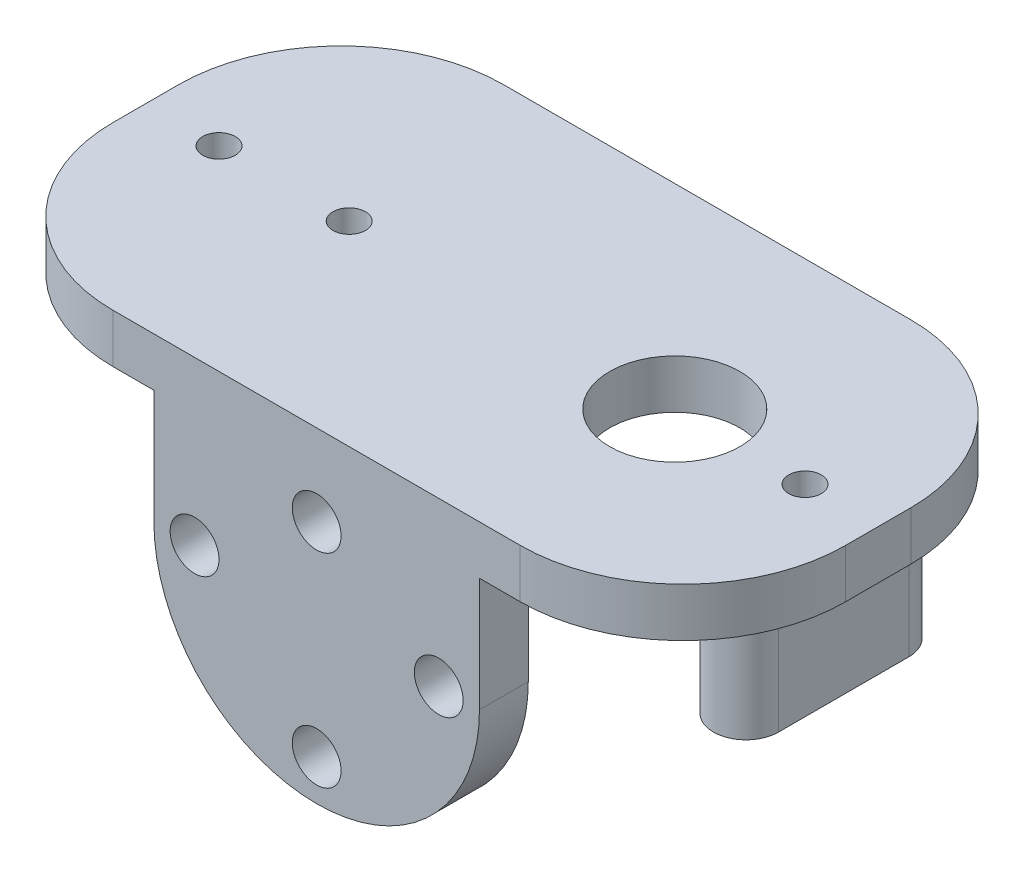
ISO-10303-21;
HEADER;
FILE_DESCRIPTION(('STEP AP214'),'2;1');
FILE_NAME('part.step','',(''),(''),'','','');
FILE_SCHEMA(('AUTOMOTIVE_DESIGN { 1 0 10303 214 1 1 1 1 }'));
ENDSEC;
DATA;
#1=APPLICATION_CONTEXT('core data for automotive mechanical design processes');
#2=APPLICATION_PROTOCOL_DEFINITION('international standard','automotive_design',2000,#1);
#3=PRODUCT_CONTEXT('',#1,'mechanical');
#4=PRODUCT('Part','Part','',(#3));
#5=PRODUCT_RELATED_PRODUCT_CATEGORY('part','',(#4));
#6=PRODUCT_DEFINITION_FORMATION('','',#4);
#7=PRODUCT_DEFINITION_CONTEXT('part definition',#1,'design');
#8=PRODUCT_DEFINITION('design','',#6,#7);
#9=PRODUCT_DEFINITION_SHAPE('','',#8);
#10=(LENGTH_UNIT() NAMED_UNIT(*) SI_UNIT(.MILLI.,.METRE.));
#11=(NAMED_UNIT(*) PLANE_ANGLE_UNIT() SI_UNIT($,.RADIAN.));
#12=(NAMED_UNIT(*) SI_UNIT($,.STERADIAN.) SOLID_ANGLE_UNIT());
#13=UNCERTAINTY_MEASURE_WITH_UNIT(LENGTH_MEASURE(1.E-05),#10,'distance_accuracy_value','');
#14=(GEOMETRIC_REPRESENTATION_CONTEXT(3) GLOBAL_UNCERTAINTY_ASSIGNED_CONTEXT((#13)) GLOBAL_UNIT_ASSIGNED_CONTEXT((#10,
#11,#12)) REPRESENTATION_CONTEXT('',''));
#15=CARTESIAN_POINT('',(0.,0.,0.));
#16=DIRECTION('',(0.,0.,1.));
#17=DIRECTION('',(1.,0.,0.));
#18=AXIS2_PLACEMENT_3D('',#15,#16,#17);
#19=CARTESIAN_POINT('',(18.7492490636064,-2.,0.11463342872871));
#20=DIRECTION('',(0.,-1.,0.));
#21=DIRECTION('',(0.,0.,-1.));
#22=AXIS2_PLACEMENT_3D('',#19,#20,#21);
#23=PLANE('',#22);
#24=CARTESIAN_POINT('',(18.7492490636064,-2.,0.11463342872871));
#25=DIRECTION('',(0.,-1.,0.));
#26=DIRECTION('',(0.,0.,-1.));
#27=AXIS2_PLACEMENT_3D('',#24,#25,#26);
#28=CIRCLE('',#27,1.);
#29=CARTESIAN_POINT('',(18.7492490636064,-2.,-0.885366571271291));
#30=VERTEX_POINT('',#29);
#31=EDGE_CURVE('E20',#30,#30,#28,.T.);
#32=ORIENTED_EDGE('',*,*,#31,.T.);
#33=EDGE_LOOP('',(#32));
#34=FACE_BOUND('',#33,.T.);
#35=ADVANCED_FACE('F17',(#34),#23,.T.);
#36=CARTESIAN_POINT('',(-9.24834793993413,-2.,-0.252193543203161));
#37=DIRECTION('',(0.,-1.,0.));
#38=DIRECTION('',(0.,0.,-1.));
#39=AXIS2_PLACEMENT_3D('',#36,#37,#38);
#40=PLANE('',#39);
#41=CARTESIAN_POINT('',(-9.24834793993413,-2.,-0.252193543203161));
#42=DIRECTION('',(0.,-1.,0.));
#43=DIRECTION('',(0.,0.,-1.));
#44=AXIS2_PLACEMENT_3D('',#41,#42,#43);
#45=CIRCLE('',#44,1.);
#46=CARTESIAN_POINT('',(-9.24834793993413,-2.,-1.25219354320316));
#47=VERTEX_POINT('',#46);
#48=EDGE_CURVE('E300',#47,#47,#45,.T.);
#49=ORIENTED_EDGE('',*,*,#48,.T.);
#50=EDGE_LOOP('',(#49));
#51=FACE_BOUND('',#50,.T.);
#52=ADVANCED_FACE('F311',(#51),#40,.T.);
#53=CARTESIAN_POINT('',(18.7492490636064,-2.,0.11463342872871));
#54=DIRECTION('',(0.,-1.,0.));
#55=DIRECTION('',(0.,0.,-1.));
#56=AXIS2_PLACEMENT_3D('',#53,#54,#55);
#57=CYLINDRICAL_SURFACE('',#56,1.);
#58=CARTESIAN_POINT('',(18.7492490636064,-7.,0.11463342872871));
#59=DIRECTION('',(0.,-1.,0.));
#60=DIRECTION('',(0.,0.,-1.));
#61=AXIS2_PLACEMENT_3D('',#58,#59,#60);
#62=CIRCLE('',#61,1.);
#63=CARTESIAN_POINT('',(18.7492490636064,-7.,-0.885366571271291));
#64=VERTEX_POINT('',#63);
#65=EDGE_CURVE('E298',#64,#64,#62,.F.);
#66=ORIENTED_EDGE('',*,*,#65,.F.);
#67=EDGE_LOOP('',(#66));
#68=FACE_BOUND('',#67,.T.);
#69=ORIENTED_EDGE('',*,*,#31,.F.);
#70=EDGE_LOOP('',(#69));
#71=FACE_BOUND('',#70,.T.);
#72=ADVANCED_FACE('F308',(#68,#71),#57,.F.);
#73=CARTESIAN_POINT('',(-9.24834793993413,-2.,-0.252193543203161));
#74=DIRECTION('',(0.,-1.,0.));
#75=DIRECTION('',(0.,0.,-1.));
#76=AXIS2_PLACEMENT_3D('',#73,#74,#75);
#77=CYLINDRICAL_SURFACE('',#76,1.);
#78=CARTESIAN_POINT('',(-9.24834793993413,-7.,-0.252193543203161));
#79=DIRECTION('',(0.,-1.,0.));
#80=DIRECTION('',(0.,0.,-1.));
#81=AXIS2_PLACEMENT_3D('',#78,#79,#80);
#82=CIRCLE('',#81,1.);
#83=CARTESIAN_POINT('',(-9.24834793993413,-7.,-1.25219354320316));
#84=VERTEX_POINT('',#83);
#85=EDGE_CURVE('E164',#84,#84,#82,.F.);
#86=ORIENTED_EDGE('',*,*,#85,.F.);
#87=EDGE_LOOP('',(#86));
#88=FACE_BOUND('',#87,.T.);
#89=ORIENTED_EDGE('',*,*,#48,.F.);
#90=EDGE_LOOP('',(#89));
#91=FACE_BOUND('',#90,.T.);
#92=ADVANCED_FACE('F310',(#88,#91),#77,.F.);
#93=CARTESIAN_POINT('',(0.,-7.,0.));
#94=DIRECTION('',(0.,-1.,0.));
#95=DIRECTION('',(0.,0.,-1.));
#96=AXIS2_PLACEMENT_3D('',#93,#94,#95);
#97=PLANE('',#96);
#98=DIRECTION('',(0.,0.,1.));
#99=VECTOR('',#98,1.);
#100=CARTESIAN_POINT('',(20.3736323404437,-7.,6.));
#101=LINE('',#100,#99);
#102=CARTESIAN_POINT('',(20.3736323404437,-7.,-4.));
#103=VERTEX_POINT('',#102);
#104=CARTESIAN_POINT('',(20.3736323404437,-7.,4.));
#105=VERTEX_POINT('',#104);
#106=EDGE_CURVE('E184',#103,#105,#101,.T.);
#107=ORIENTED_EDGE('',*,*,#106,.T.);
#108=CARTESIAN_POINT('',(18.3736323404437,-7.,4.));
#109=DIRECTION('',(0.,1.,0.));
#110=DIRECTION('',(0.,0.,1.));
#111=AXIS2_PLACEMENT_3D('',#108,#109,#110);
#112=CIRCLE('',#111,2.);
#113=CARTESIAN_POINT('',(16.3736323404437,-7.,4.));
#114=VERTEX_POINT('',#113);
#115=EDGE_CURVE('E161',#114,#105,#112,.T.);
#116=ORIENTED_EDGE('',*,*,#115,.F.);
#117=DIRECTION('',(0.,0.,-1.));
#118=VECTOR('',#117,1.);
#119=CARTESIAN_POINT('',(16.3736323404437,-7.,6.));
#120=LINE('',#119,#118);
#121=CARTESIAN_POINT('',(16.3736323404437,-7.,-4.));
#122=VERTEX_POINT('',#121);
#123=EDGE_CURVE('E158',#114,#122,#120,.T.);
#124=ORIENTED_EDGE('',*,*,#123,.T.);
#125=CARTESIAN_POINT('',(18.3736323404437,-7.,-4.));
#126=DIRECTION('',(0.,1.,0.));
#127=DIRECTION('',(0.,0.,1.));
#128=AXIS2_PLACEMENT_3D('',#125,#126,#127);
#129=CIRCLE('',#128,2.);
#130=EDGE_CURVE('E146',#103,#122,#129,.T.);
#131=ORIENTED_EDGE('',*,*,#130,.F.);
#132=EDGE_LOOP('',(#107,#116,#124,#131));
#133=FACE_BOUND('',#132,.T.);
#134=ORIENTED_EDGE('',*,*,#65,.T.);
#135=EDGE_LOOP('',(#134));
#136=FACE_BOUND('',#135,.T.);
#137=ADVANCED_FACE('F159',(#133,#136),#97,.T.);
#138=CARTESIAN_POINT('',(0.,-7.,0.));
#139=DIRECTION('',(0.,-1.,0.));
#140=DIRECTION('',(0.,0.,-1.));
#141=AXIS2_PLACEMENT_3D('',#138,#139,#140);
#142=PLANE('',#141);
#143=DIRECTION('',(0.,0.,1.));
#144=VECTOR('',#143,1.);
#145=CARTESIAN_POINT('',(-7.12636765955629,-7.,6.));
#146=LINE('',#145,#144);
#147=CARTESIAN_POINT('',(-7.12636765955629,-7.,-4.));
#148=VERTEX_POINT('',#147);
#149=CARTESIAN_POINT('',(-7.12636765955629,-7.,4.));
#150=VERTEX_POINT('',#149);
#151=EDGE_CURVE('E179',#148,#150,#146,.T.);
#152=ORIENTED_EDGE('',*,*,#151,.T.);
#153=CARTESIAN_POINT('',(-9.12636765955629,-7.,4.));
#154=DIRECTION('',(0.,1.,0.));
#155=DIRECTION('',(0.,0.,1.));
#156=AXIS2_PLACEMENT_3D('',#153,#154,#155);
#157=CIRCLE('',#156,2.);
#158=CARTESIAN_POINT('',(-11.1263676595563,-7.,4.));
#159=VERTEX_POINT('',#158);
#160=EDGE_CURVE('E291',#159,#150,#157,.T.);
#161=ORIENTED_EDGE('',*,*,#160,.F.);
#162=DIRECTION('',(0.,0.,-1.));
#163=VECTOR('',#162,1.);
#164=CARTESIAN_POINT('',(-11.1263676595563,-7.,6.));
#165=LINE('',#164,#163);
#166=CARTESIAN_POINT('',(-11.1263676595563,-7.,-4.));
#167=VERTEX_POINT('',#166);
#168=EDGE_CURVE('E174',#159,#167,#165,.T.);
#169=ORIENTED_EDGE('',*,*,#168,.T.);
#170=CARTESIAN_POINT('',(-9.12636765955629,-7.,-4.));
#171=DIRECTION('',(0.,1.,0.));
#172=DIRECTION('',(0.,0.,1.));
#173=AXIS2_PLACEMENT_3D('',#170,#171,#172);
#174=CIRCLE('',#173,2.);
#175=EDGE_CURVE('E293',#148,#167,#174,.T.);
#176=ORIENTED_EDGE('',*,*,#175,.F.);
#177=EDGE_LOOP('',(#152,#161,#169,#176));
#178=FACE_BOUND('',#177,.T.);
#179=ORIENTED_EDGE('',*,*,#85,.T.);
#180=EDGE_LOOP('',(#179));
#181=FACE_BOUND('',#180,.T.);
#182=ADVANCED_FACE('F450',(#178,#181),#142,.T.);
#183=CARTESIAN_POINT('',(16.3736323404437,-7.,6.));
#184=DIRECTION('',(1.,0.,0.));
#185=DIRECTION('',(0.,0.,-1.));
#186=AXIS2_PLACEMENT_3D('',#183,#184,#185);
#187=PLANE('',#186);
#188=DIRECTION('',(0.,1.,0.));
#189=VECTOR('',#188,1.);
#190=CARTESIAN_POINT('',(16.3736323404437,-7.,-4.));
#191=LINE('',#190,#189);
#192=CARTESIAN_POINT('',(16.3736323404437,0.,-4.));
#193=VERTEX_POINT('',#192);
#194=EDGE_CURVE('E152',#122,#193,#191,.T.);
#195=ORIENTED_EDGE('',*,*,#194,.F.);
#196=ORIENTED_EDGE('',*,*,#123,.F.);
#197=DIRECTION('',(0.,1.,0.));
#198=VECTOR('',#197,1.);
#199=CARTESIAN_POINT('',(16.3736323404437,-7.,4.));
#200=LINE('',#199,#198);
#201=CARTESIAN_POINT('',(16.3736323404437,0.,4.));
#202=VERTEX_POINT('',#201);
#203=EDGE_CURVE('E178',#202,#114,#200,.F.);
#204=ORIENTED_EDGE('',*,*,#203,.F.);
#205=DIRECTION('',(0.,0.,1.));
#206=VECTOR('',#205,1.);
#207=CARTESIAN_POINT('',(16.3736323404437,0.,0.));
#208=LINE('',#207,#206);
#209=EDGE_CURVE('E169',#202,#193,#208,.F.);
#210=ORIENTED_EDGE('',*,*,#209,.T.);
#211=EDGE_LOOP('',(#195,#196,#204,#210));
#212=FACE_BOUND('',#211,.T.);
#213=ADVANCED_FACE('F167',(#212),#187,.F.);
#214=CARTESIAN_POINT('',(18.3736323404437,-7.,-4.));
#215=DIRECTION('',(0.,1.,0.));
#216=DIRECTION('',(0.,0.,1.));
#217=AXIS2_PLACEMENT_3D('',#214,#215,#216);
#218=CYLINDRICAL_SURFACE('',#217,2.);
#219=ORIENTED_EDGE('',*,*,#130,.T.);
#220=ORIENTED_EDGE('',*,*,#194,.T.);
#221=CARTESIAN_POINT('',(18.3736323404437,0.,-4.));
#222=DIRECTION('',(0.,1.,0.));
#223=DIRECTION('',(0.,0.,1.));
#224=AXIS2_PLACEMENT_3D('',#221,#222,#223);
#225=CIRCLE('',#224,2.);
#226=CARTESIAN_POINT('',(20.3736323404437,0.,-4.));
#227=VERTEX_POINT('',#226);
#228=EDGE_CURVE('E271',#193,#227,#225,.F.);
#229=ORIENTED_EDGE('',*,*,#228,.T.);
#230=DIRECTION('',(0.,1.,0.));
#231=VECTOR('',#230,1.);
#232=CARTESIAN_POINT('',(20.3736323404437,-7.,-4.));
#233=LINE('',#232,#231);
#234=EDGE_CURVE('E154',#227,#103,#233,.F.);
#235=ORIENTED_EDGE('',*,*,#234,.T.);
#236=EDGE_LOOP('',(#219,#220,#229,#235));
#237=FACE_BOUND('',#236,.T.);
#238=ADVANCED_FACE('F150',(#237),#218,.T.);
#239=CARTESIAN_POINT('',(20.3736323404437,-7.,6.));
#240=DIRECTION('',(-1.,0.,0.));
#241=DIRECTION('',(0.,0.,1.));
#242=AXIS2_PLACEMENT_3D('',#239,#240,#241);
#243=PLANE('',#242);
#244=ORIENTED_EDGE('',*,*,#234,.F.);
#245=DIRECTION('',(0.,0.,1.));
#246=VECTOR('',#245,1.);
#247=CARTESIAN_POINT('',(20.3736323404437,0.,0.));
#248=LINE('',#247,#246);
#249=CARTESIAN_POINT('',(20.3736323404437,0.,4.));
#250=VERTEX_POINT('',#249);
#251=EDGE_CURVE('E270',#227,#250,#248,.T.);
#252=ORIENTED_EDGE('',*,*,#251,.T.);
#253=DIRECTION('',(0.,1.,0.));
#254=VECTOR('',#253,1.);
#255=CARTESIAN_POINT('',(20.3736323404437,-7.,4.));
#256=LINE('',#255,#254);
#257=EDGE_CURVE('E185',#105,#250,#256,.T.);
#258=ORIENTED_EDGE('',*,*,#257,.F.);
#259=ORIENTED_EDGE('',*,*,#106,.F.);
#260=EDGE_LOOP('',(#244,#252,#258,#259));
#261=FACE_BOUND('',#260,.T.);
#262=ADVANCED_FACE('F441',(#261),#243,.F.);
#263=CARTESIAN_POINT('',(18.3736323404437,-7.,4.));
#264=DIRECTION('',(0.,1.,0.));
#265=DIRECTION('',(0.,0.,1.));
#266=AXIS2_PLACEMENT_3D('',#263,#264,#265);
#267=CYLINDRICAL_SURFACE('',#266,2.);
#268=CARTESIAN_POINT('',(18.3736323404437,0.,4.));
#269=DIRECTION('',(0.,1.,0.));
#270=DIRECTION('',(0.,0.,1.));
#271=AXIS2_PLACEMENT_3D('',#268,#269,#270);
#272=CIRCLE('',#271,2.);
#273=EDGE_CURVE('E267',#250,#202,#272,.F.);
#274=ORIENTED_EDGE('',*,*,#273,.T.);
#275=ORIENTED_EDGE('',*,*,#203,.T.);
#276=ORIENTED_EDGE('',*,*,#115,.T.);
#277=ORIENTED_EDGE('',*,*,#257,.T.);
#278=EDGE_LOOP('',(#274,#275,#276,#277));
#279=FACE_BOUND('',#278,.T.);
#280=ADVANCED_FACE('F437',(#279),#267,.T.);
#281=CARTESIAN_POINT('',(-11.1263676595563,-7.,6.));
#282=DIRECTION('',(1.,0.,0.));
#283=DIRECTION('',(0.,0.,-1.));
#284=AXIS2_PLACEMENT_3D('',#281,#282,#283);
#285=PLANE('',#284);
#286=DIRECTION('',(0.,1.,0.));
#287=VECTOR('',#286,1.);
#288=CARTESIAN_POINT('',(-11.1263676595563,-7.,-4.));
#289=LINE('',#288,#287);
#290=CARTESIAN_POINT('',(-11.1263676595563,0.,-4.));
#291=VERTEX_POINT('',#290);
#292=EDGE_CURVE('E177',#167,#291,#289,.T.);
#293=ORIENTED_EDGE('',*,*,#292,.F.);
#294=ORIENTED_EDGE('',*,*,#168,.F.);
#295=DIRECTION('',(0.,1.,0.));
#296=VECTOR('',#295,1.);
#297=CARTESIAN_POINT('',(-11.1263676595563,-7.,4.));
#298=LINE('',#297,#296);
#299=CARTESIAN_POINT('',(-11.1263676595563,0.,4.));
#300=VERTEX_POINT('',#299);
#301=EDGE_CURVE('E290',#300,#159,#298,.F.);
#302=ORIENTED_EDGE('',*,*,#301,.F.);
#303=DIRECTION('',(0.,0.,1.));
#304=VECTOR('',#303,1.);
#305=CARTESIAN_POINT('',(-11.1263676595563,0.,0.));
#306=LINE('',#305,#304);
#307=EDGE_CURVE('E266',#300,#291,#306,.F.);
#308=ORIENTED_EDGE('',*,*,#307,.T.);
#309=EDGE_LOOP('',(#293,#294,#302,#308));
#310=FACE_BOUND('',#309,.T.);
#311=ADVANCED_FACE('F433',(#310),#285,.F.);
#312=CARTESIAN_POINT('',(-9.12636765955629,-7.,-4.));
#313=DIRECTION('',(0.,1.,0.));
#314=DIRECTION('',(0.,0.,1.));
#315=AXIS2_PLACEMENT_3D('',#312,#313,#314);
#316=CYLINDRICAL_SURFACE('',#315,2.);
#317=ORIENTED_EDGE('',*,*,#175,.T.);
#318=ORIENTED_EDGE('',*,*,#292,.T.);
#319=CARTESIAN_POINT('',(-9.12636765955629,0.,-4.));
#320=DIRECTION('',(0.,1.,0.));
#321=DIRECTION('',(0.,0.,1.));
#322=AXIS2_PLACEMENT_3D('',#319,#320,#321);
#323=CIRCLE('',#322,2.);
#324=CARTESIAN_POINT('',(-7.12636765955629,0.,-4.));
#325=VERTEX_POINT('',#324);
#326=EDGE_CURVE('E264',#291,#325,#323,.F.);
#327=ORIENTED_EDGE('',*,*,#326,.T.);
#328=DIRECTION('',(0.,1.,0.));
#329=VECTOR('',#328,1.);
#330=CARTESIAN_POINT('',(-7.12636765955629,-7.,-4.));
#331=LINE('',#330,#329);
#332=EDGE_CURVE('E182',#325,#148,#331,.F.);
#333=ORIENTED_EDGE('',*,*,#332,.T.);
#334=EDGE_LOOP('',(#317,#318,#327,#333));
#335=FACE_BOUND('',#334,.T.);
#336=ADVANCED_FACE('F429',(#335),#316,.T.);
#337=CARTESIAN_POINT('',(-7.12636765955629,-7.,6.));
#338=DIRECTION('',(-1.,0.,0.));
#339=DIRECTION('',(0.,0.,1.));
#340=AXIS2_PLACEMENT_3D('',#337,#338,#339);
#341=PLANE('',#340);
#342=ORIENTED_EDGE('',*,*,#332,.F.);
#343=DIRECTION('',(0.,0.,1.));
#344=VECTOR('',#343,1.);
#345=CARTESIAN_POINT('',(-7.12636765955629,0.,0.));
#346=LINE('',#345,#344);
#347=CARTESIAN_POINT('',(-7.12636765955629,0.,4.));
#348=VERTEX_POINT('',#347);
#349=EDGE_CURVE('E263',#325,#348,#346,.T.);
#350=ORIENTED_EDGE('',*,*,#349,.T.);
#351=DIRECTION('',(0.,1.,0.));
#352=VECTOR('',#351,1.);
#353=CARTESIAN_POINT('',(-7.12636765955629,-7.,4.));
#354=LINE('',#353,#352);
#355=EDGE_CURVE('E181',#150,#348,#354,.T.);
#356=ORIENTED_EDGE('',*,*,#355,.F.);
#357=ORIENTED_EDGE('',*,*,#151,.F.);
#358=EDGE_LOOP('',(#342,#350,#356,#357));
#359=FACE_BOUND('',#358,.T.);
#360=ADVANCED_FACE('F425',(#359),#341,.F.);
#361=CARTESIAN_POINT('',(-9.12636765955629,-7.,4.));
#362=DIRECTION('',(0.,1.,0.));
#363=DIRECTION('',(0.,0.,1.));
#364=AXIS2_PLACEMENT_3D('',#361,#362,#363);
#365=CYLINDRICAL_SURFACE('',#364,2.);
#366=CARTESIAN_POINT('',(-9.12636765955629,0.,4.));
#367=DIRECTION('',(0.,1.,0.));
#368=DIRECTION('',(0.,0.,1.));
#369=AXIS2_PLACEMENT_3D('',#366,#367,#368);
#370=CIRCLE('',#369,2.);
#371=EDGE_CURVE('E259',#348,#300,#370,.F.);
#372=ORIENTED_EDGE('',*,*,#371,.T.);
#373=ORIENTED_EDGE('',*,*,#301,.T.);
#374=ORIENTED_EDGE('',*,*,#160,.T.);
#375=ORIENTED_EDGE('',*,*,#355,.T.);
#376=EDGE_LOOP('',(#372,#373,#374,#375));
#377=FACE_BOUND('',#376,.T.);
#378=ADVANCED_FACE('F421',(#377),#365,.T.);
#379=CARTESIAN_POINT('',(-10.,-17.,9.00000000000001));
#380=DIRECTION('',(0.,0.,1.));
#381=DIRECTION('',(1.,0.,0.));
#382=AXIS2_PLACEMENT_3D('',#379,#380,#381);
#383=PLANE('',#382);
#384=CARTESIAN_POINT('',(0.,-7.,9.00000000000001));
#385=DIRECTION('',(0.,0.,1.));
#386=DIRECTION('',(1.,0.,0.));
#387=AXIS2_PLACEMENT_3D('',#384,#385,#386);
#388=CIRCLE('',#387,10.);
#389=CARTESIAN_POINT('',(-10.,-7.,9.00000000000001));
#390=VERTEX_POINT('',#389);
#391=CARTESIAN_POINT('',(10.,-7.,9.00000000000001));
#392=VERTEX_POINT('',#391);
#393=EDGE_CURVE('E273',#390,#392,#388,.T.);
#394=ORIENTED_EDGE('',*,*,#393,.F.);
#395=DIRECTION('',(0.,1.,0.));
#396=VECTOR('',#395,1.);
#397=CARTESIAN_POINT('',(-10.,-17.,9.00000000000001));
#398=LINE('',#397,#396);
#399=CARTESIAN_POINT('',(-10.,0.,9.00000000000001));
#400=VERTEX_POINT('',#399);
#401=EDGE_CURVE('E715',#390,#400,#398,.T.);
#402=ORIENTED_EDGE('',*,*,#401,.T.);
#403=DIRECTION('',(1.,0.,0.));
#404=VECTOR('',#403,1.);
#405=CARTESIAN_POINT('',(0.,0.,9.00000000000001));
#406=LINE('',#405,#404);
#407=CARTESIAN_POINT('',(10.,0.,9.00000000000001));
#408=VERTEX_POINT('',#407);
#409=EDGE_CURVE('E262',#400,#408,#406,.T.);
#410=ORIENTED_EDGE('',*,*,#409,.T.);
#411=DIRECTION('',(0.,1.,0.));
#412=VECTOR('',#411,1.);
#413=CARTESIAN_POINT('',(10.,-17.,9.00000000000001));
#414=LINE('',#413,#412);
#415=EDGE_CURVE('E280',#408,#392,#414,.F.);
#416=ORIENTED_EDGE('',*,*,#415,.T.);
#417=EDGE_LOOP('',(#394,#402,#410,#416));
#418=FACE_BOUND('',#417,.T.);
#419=CARTESIAN_POINT('',(0.,-14.5,9.));
#420=DIRECTION('',(0.,0.,1.));
#421=DIRECTION('',(1.,0.,0.));
#422=AXIS2_PLACEMENT_3D('',#419,#420,#421);
#423=CIRCLE('',#422,1.5);
#424=CARTESIAN_POINT('',(1.5,-14.5,9.));
#425=VERTEX_POINT('',#424);
#426=EDGE_CURVE('E277',#425,#425,#423,.T.);
#427=ORIENTED_EDGE('',*,*,#426,.T.);
#428=EDGE_LOOP('',(#427));
#429=FACE_BOUND('',#428,.T.);
#430=CARTESIAN_POINT('',(-7.5,-7.00000000000007,9.));
#431=DIRECTION('',(0.,0.,1.));
#432=DIRECTION('',(1.,0.,0.));
#433=AXIS2_PLACEMENT_3D('',#430,#431,#432);
#434=CIRCLE('',#433,1.5);
#435=CARTESIAN_POINT('',(-6.,-7.00000000000007,9.));
#436=VERTEX_POINT('',#435);
#437=EDGE_CURVE('E281',#436,#436,#434,.T.);
#438=ORIENTED_EDGE('',*,*,#437,.T.);
#439=EDGE_LOOP('',(#438));
#440=FACE_BOUND('',#439,.T.);
#441=CARTESIAN_POINT('',(7.5,-7.,9.));
#442=DIRECTION('',(0.,0.,1.));
#443=DIRECTION('',(1.,0.,0.));
#444=AXIS2_PLACEMENT_3D('',#441,#442,#443);
#445=CIRCLE('',#444,1.5);
#446=CARTESIAN_POINT('',(9.00000000000001,-7.,9.));
#447=VERTEX_POINT('',#446);
#448=EDGE_CURVE('E284',#447,#447,#445,.T.);
#449=ORIENTED_EDGE('',*,*,#448,.T.);
#450=EDGE_LOOP('',(#449));
#451=FACE_BOUND('',#450,.T.);
#452=CARTESIAN_POINT('',(0.,-2.,9.));
#453=DIRECTION('',(0.,0.,1.));
#454=DIRECTION('',(1.,0.,0.));
#455=AXIS2_PLACEMENT_3D('',#452,#453,#454);
#456=CIRCLE('',#455,1.5);
#457=CARTESIAN_POINT('',(1.5,-2.,9.));
#458=VERTEX_POINT('',#457);
#459=EDGE_CURVE('E287',#458,#458,#456,.T.);
#460=ORIENTED_EDGE('',*,*,#459,.T.);
#461=EDGE_LOOP('',(#460));
#462=FACE_BOUND('',#461,.T.);
#463=ADVANCED_FACE('F417',(#418,#429,#440,#451,#462),#383,.F.);
#464=CARTESIAN_POINT('',(0.,0.,0.));
#465=DIRECTION('',(0.,-1.,0.));
#466=DIRECTION('',(0.,0.,-1.));
#467=AXIS2_PLACEMENT_3D('',#464,#465,#466);
#468=PLANE('',#467);
#469=CARTESIAN_POINT('',(18.,0.,0.));
#470=DIRECTION('',(0.,1.,0.));
#471=DIRECTION('',(0.,0.,1.));
#472=AXIS2_PLACEMENT_3D('',#469,#470,#471);
#473=CIRCLE('',#472,1.);
#474=CARTESIAN_POINT('',(18.,0.,1.));
#475=VERTEX_POINT('',#474);
#476=EDGE_CURVE('E255',#475,#475,#473,.T.);
#477=ORIENTED_EDGE('',*,*,#476,.T.);
#478=EDGE_LOOP('',(#477));
#479=FACE_BOUND('',#478,.T.);
#480=ADVANCED_FACE('F413',(#479),#468,.F.);
#481=CARTESIAN_POINT('',(0.,0.,0.));
#482=DIRECTION('',(0.,-1.,0.));
#483=DIRECTION('',(0.,0.,-1.));
#484=AXIS2_PLACEMENT_3D('',#481,#482,#483);
#485=PLANE('',#484);
#486=CARTESIAN_POINT('',(-10.,0.,0.));
#487=DIRECTION('',(0.,1.,0.));
#488=DIRECTION('',(0.,0.,1.));
#489=AXIS2_PLACEMENT_3D('',#486,#487,#488);
#490=CIRCLE('',#489,1.);
#491=CARTESIAN_POINT('',(-10.,0.,1.));
#492=VERTEX_POINT('',#491);
#493=EDGE_CURVE('E252',#492,#492,#490,.T.);
#494=ORIENTED_EDGE('',*,*,#493,.T.);
#495=EDGE_LOOP('',(#494));
#496=FACE_BOUND('',#495,.T.);
#497=ADVANCED_FACE('F409',(#496),#485,.F.);
#498=CARTESIAN_POINT('',(0.,-2.,9.));
#499=DIRECTION('',(0.,0.,1.));
#500=DIRECTION('',(1.,0.,0.));
#501=AXIS2_PLACEMENT_3D('',#498,#499,#500);
#502=CYLINDRICAL_SURFACE('',#501,1.5);
#503=ORIENTED_EDGE('',*,*,#459,.F.);
#504=EDGE_LOOP('',(#503));
#505=FACE_BOUND('',#504,.T.);
#506=CARTESIAN_POINT('',(0.,-2.,12.));
#507=DIRECTION('',(0.,0.,1.));
#508=DIRECTION('',(1.,0.,0.));
#509=AXIS2_PLACEMENT_3D('',#506,#507,#508);
#510=CIRCLE('',#509,1.5);
#511=CARTESIAN_POINT('',(1.5,-2.,12.));
#512=VERTEX_POINT('',#511);
#513=EDGE_CURVE('E238',#512,#512,#510,.T.);
#514=ORIENTED_EDGE('',*,*,#513,.T.);
#515=EDGE_LOOP('',(#514));
#516=FACE_BOUND('',#515,.T.);
#517=ADVANCED_FACE('F405',(#505,#516),#502,.F.);
#518=CARTESIAN_POINT('',(7.5,-7.,9.));
#519=DIRECTION('',(0.,0.,1.));
#520=DIRECTION('',(1.,0.,0.));
#521=AXIS2_PLACEMENT_3D('',#518,#519,#520);
#522=CYLINDRICAL_SURFACE('',#521,1.5);
#523=ORIENTED_EDGE('',*,*,#448,.F.);
#524=EDGE_LOOP('',(#523));
#525=FACE_BOUND('',#524,.T.);
#526=CARTESIAN_POINT('',(7.5,-7.,12.));
#527=DIRECTION('',(0.,0.,1.));
#528=DIRECTION('',(1.,0.,0.));
#529=AXIS2_PLACEMENT_3D('',#526,#527,#528);
#530=CIRCLE('',#529,1.5);
#531=CARTESIAN_POINT('',(9.00000000000001,-7.,12.));
#532=VERTEX_POINT('',#531);
#533=EDGE_CURVE('E235',#532,#532,#530,.T.);
#534=ORIENTED_EDGE('',*,*,#533,.T.);
#535=EDGE_LOOP('',(#534));
#536=FACE_BOUND('',#535,.T.);
#537=ADVANCED_FACE('F401',(#525,#536),#522,.F.);
#538=CARTESIAN_POINT('',(-7.5,-7.00000000000007,9.));
#539=DIRECTION('',(0.,0.,1.));
#540=DIRECTION('',(1.,0.,0.));
#541=AXIS2_PLACEMENT_3D('',#538,#539,#540);
#542=CYLINDRICAL_SURFACE('',#541,1.5);
#543=ORIENTED_EDGE('',*,*,#437,.F.);
#544=EDGE_LOOP('',(#543));
#545=FACE_BOUND('',#544,.T.);
#546=CARTESIAN_POINT('',(-7.5,-7.00000000000007,12.));
#547=DIRECTION('',(0.,0.,1.));
#548=DIRECTION('',(1.,0.,0.));
#549=AXIS2_PLACEMENT_3D('',#546,#547,#548);
#550=CIRCLE('',#549,1.5);
#551=CARTESIAN_POINT('',(-6.,-7.00000000000007,12.));
#552=VERTEX_POINT('',#551);
#553=EDGE_CURVE('E232',#552,#552,#550,.T.);
#554=ORIENTED_EDGE('',*,*,#553,.T.);
#555=EDGE_LOOP('',(#554));
#556=FACE_BOUND('',#555,.T.);
#557=ADVANCED_FACE('F397',(#545,#556),#542,.F.);
#558=CARTESIAN_POINT('',(0.,-14.5,9.));
#559=DIRECTION('',(0.,0.,1.));
#560=DIRECTION('',(1.,0.,0.));
#561=AXIS2_PLACEMENT_3D('',#558,#559,#560);
#562=CYLINDRICAL_SURFACE('',#561,1.5);
#563=ORIENTED_EDGE('',*,*,#426,.F.);
#564=EDGE_LOOP('',(#563));
#565=FACE_BOUND('',#564,.T.);
#566=CARTESIAN_POINT('',(0.,-14.5,12.));
#567=DIRECTION('',(0.,0.,1.));
#568=DIRECTION('',(1.,0.,0.));
#569=AXIS2_PLACEMENT_3D('',#566,#567,#568);
#570=CIRCLE('',#569,1.5);
#571=CARTESIAN_POINT('',(1.5,-14.5,12.));
#572=VERTEX_POINT('',#571);
#573=EDGE_CURVE('E228',#572,#572,#570,.T.);
#574=ORIENTED_EDGE('',*,*,#573,.T.);
#575=EDGE_LOOP('',(#574));
#576=FACE_BOUND('',#575,.T.);
#577=ADVANCED_FACE('F393',(#565,#576),#562,.F.);
#578=CARTESIAN_POINT('',(10.,-17.,12.));
#579=DIRECTION('',(-1.,0.,0.));
#580=DIRECTION('',(0.,0.,1.));
#581=AXIS2_PLACEMENT_3D('',#578,#579,#580);
#582=PLANE('',#581);
#583=DIRECTION('',(0.,0.,-1.));
#584=VECTOR('',#583,1.);
#585=CARTESIAN_POINT('',(10.,-7.,0.));
#586=LINE('',#585,#584);
#587=CARTESIAN_POINT('',(10.,-7.,12.));
#588=VERTEX_POINT('',#587);
#589=EDGE_CURVE('E276',#392,#588,#586,.F.);
#590=ORIENTED_EDGE('',*,*,#589,.F.);
#591=ORIENTED_EDGE('',*,*,#415,.F.);
#592=DIRECTION('',(0.,0.,1.));
#593=VECTOR('',#592,1.);
#594=CARTESIAN_POINT('',(10.,0.,0.));
#595=LINE('',#594,#593);
#596=CARTESIAN_POINT('',(10.,0.,12.));
#597=VERTEX_POINT('',#596);
#598=EDGE_CURVE('E734',#408,#597,#595,.T.);
#599=ORIENTED_EDGE('',*,*,#598,.T.);
#600=DIRECTION('',(0.,1.,0.));
#601=VECTOR('',#600,1.);
#602=CARTESIAN_POINT('',(10.,3.,12.));
#603=LINE('',#602,#601);
#604=EDGE_CURVE('E227',#597,#588,#603,.F.);
#605=ORIENTED_EDGE('',*,*,#604,.T.);
#606=EDGE_LOOP('',(#590,#591,#599,#605));
#607=FACE_BOUND('',#606,.T.);
#608=ADVANCED_FACE('F389',(#607),#582,.F.);
#609=CARTESIAN_POINT('',(0.,-7.,0.));
#610=DIRECTION('',(0.,0.,1.));
#611=DIRECTION('',(1.,0.,0.));
#612=AXIS2_PLACEMENT_3D('',#609,#610,#611);
#613=CYLINDRICAL_SURFACE('',#612,10.);
#614=ORIENTED_EDGE('',*,*,#393,.T.);
#615=ORIENTED_EDGE('',*,*,#589,.T.);
#616=CARTESIAN_POINT('',(0.,-7.,12.));
#617=DIRECTION('',(0.,0.,1.));
#618=DIRECTION('',(1.,0.,0.));
#619=AXIS2_PLACEMENT_3D('',#616,#617,#618);
#620=CIRCLE('',#619,10.);
#621=CARTESIAN_POINT('',(-10.,-7.,12.));
#622=VERTEX_POINT('',#621);
#623=EDGE_CURVE('E224',#588,#622,#620,.F.);
#624=ORIENTED_EDGE('',*,*,#623,.T.);
#625=DIRECTION('',(0.,0.,-1.));
#626=VECTOR('',#625,1.);
#627=CARTESIAN_POINT('',(-10.,-7.,12.));
#628=LINE('',#627,#626);
#629=EDGE_CURVE('E275',#622,#390,#628,.T.);
#630=ORIENTED_EDGE('',*,*,#629,.T.);
#631=EDGE_LOOP('',(#614,#615,#624,#630));
#632=FACE_BOUND('',#631,.T.);
#633=ADVANCED_FACE('F385',(#632),#613,.T.);
#634=CARTESIAN_POINT('',(-10.,-17.,12.));
#635=DIRECTION('',(1.,0.,0.));
#636=DIRECTION('',(0.,0.,-1.));
#637=AXIS2_PLACEMENT_3D('',#634,#635,#636);
#638=PLANE('',#637);
#639=ORIENTED_EDGE('',*,*,#629,.F.);
#640=DIRECTION('',(0.,1.,0.));
#641=VECTOR('',#640,1.);
#642=CARTESIAN_POINT('',(-10.,3.,12.));
#643=LINE('',#642,#641);
#644=CARTESIAN_POINT('',(-10.,0.,12.));
#645=VERTEX_POINT('',#644);
#646=EDGE_CURVE('E226',#622,#645,#643,.T.);
#647=ORIENTED_EDGE('',*,*,#646,.T.);
#648=DIRECTION('',(0.,0.,1.));
#649=VECTOR('',#648,1.);
#650=CARTESIAN_POINT('',(-10.,0.,0.));
#651=LINE('',#650,#649);
#652=EDGE_CURVE('E258',#645,#400,#651,.F.);
#653=ORIENTED_EDGE('',*,*,#652,.T.);
#654=ORIENTED_EDGE('',*,*,#401,.F.);
#655=EDGE_LOOP('',(#639,#647,#653,#654));
#656=FACE_BOUND('',#655,.T.);
#657=ADVANCED_FACE('F381',(#656),#638,.F.);
#658=CARTESIAN_POINT('',(0.,0.,0.));
#659=DIRECTION('',(0.,1.,0.));
#660=DIRECTION('',(0.,0.,1.));
#661=AXIS2_PLACEMENT_3D('',#658,#659,#660);
#662=PLANE('',#661);
#663=DIRECTION('',(-1.,0.,0.));
#664=VECTOR('',#663,1.);
#665=CARTESIAN_POINT('',(22.5,0.,12.));
#666=LINE('',#665,#664);
#667=CARTESIAN_POINT('',(-12.5,0.,12.));
#668=VERTEX_POINT('',#667);
#669=EDGE_CURVE('E231',#645,#668,#666,.T.);
#670=ORIENTED_EDGE('',*,*,#669,.T.);
#671=CARTESIAN_POINT('',(-12.5,0.,2.));
#672=DIRECTION('',(0.,-1.,0.));
#673=DIRECTION('',(0.,0.,-1.));
#674=AXIS2_PLACEMENT_3D('',#671,#672,#673);
#675=CIRCLE('',#674,10.);
#676=CARTESIAN_POINT('',(-22.5,0.,2.));
#677=VERTEX_POINT('',#676);
#678=EDGE_CURVE('E241',#677,#668,#675,.F.);
#679=ORIENTED_EDGE('',*,*,#678,.F.);
#680=DIRECTION('',(0.,0.,-1.));
#681=VECTOR('',#680,1.);
#682=CARTESIAN_POINT('',(-22.5,0.,12.));
#683=LINE('',#682,#681);
#684=CARTESIAN_POINT('',(-22.5,0.,-2.));
#685=VERTEX_POINT('',#684);
#686=EDGE_CURVE('E248',#677,#685,#683,.T.);
#687=ORIENTED_EDGE('',*,*,#686,.T.);
#688=CARTESIAN_POINT('',(-12.5,0.,-2.));
#689=DIRECTION('',(0.,-1.,0.));
#690=DIRECTION('',(0.,0.,-1.));
#691=AXIS2_PLACEMENT_3D('',#688,#689,#690);
#692=CIRCLE('',#691,10.);
#693=CARTESIAN_POINT('',(-12.5,0.,-12.));
#694=VERTEX_POINT('',#693);
#695=EDGE_CURVE('E212',#694,#685,#692,.F.);
#696=ORIENTED_EDGE('',*,*,#695,.F.);
#697=DIRECTION('',(1.,0.,0.));
#698=VECTOR('',#697,1.);
#699=CARTESIAN_POINT('',(22.5,0.,-12.));
#700=LINE('',#699,#698);
#701=CARTESIAN_POINT('',(12.5,0.,-12.));
#702=VERTEX_POINT('',#701);
#703=EDGE_CURVE('E716',#694,#702,#700,.T.);
#704=ORIENTED_EDGE('',*,*,#703,.T.);
#705=CARTESIAN_POINT('',(12.5,0.,-2.));
#706=DIRECTION('',(0.,-1.,0.));
#707=DIRECTION('',(0.,0.,-1.));
#708=AXIS2_PLACEMENT_3D('',#705,#706,#707);
#709=CIRCLE('',#708,10.);
#710=CARTESIAN_POINT('',(22.5,0.,-2.));
#711=VERTEX_POINT('',#710);
#712=EDGE_CURVE('E215',#711,#702,#709,.F.);
#713=ORIENTED_EDGE('',*,*,#712,.F.);
#714=DIRECTION('',(0.,0.,1.));
#715=VECTOR('',#714,1.);
#716=CARTESIAN_POINT('',(22.5,0.,12.));
#717=LINE('',#716,#715);
#718=CARTESIAN_POINT('',(22.5,0.,2.));
#719=VERTEX_POINT('',#718);
#720=EDGE_CURVE('E222',#711,#719,#717,.T.);
#721=ORIENTED_EDGE('',*,*,#720,.T.);
#722=CARTESIAN_POINT('',(12.5,0.,2.));
#723=DIRECTION('',(0.,-1.,0.));
#724=DIRECTION('',(0.,0.,-1.));
#725=AXIS2_PLACEMENT_3D('',#722,#723,#724);
#726=CIRCLE('',#725,10.);
#727=CARTESIAN_POINT('',(12.5,0.,12.));
#728=VERTEX_POINT('',#727);
#729=EDGE_CURVE('E219',#728,#719,#726,.F.);
#730=ORIENTED_EDGE('',*,*,#729,.F.);
#731=DIRECTION('',(-1.,0.,0.));
#732=VECTOR('',#731,1.);
#733=CARTESIAN_POINT('',(22.5,0.,12.));
#734=LINE('',#733,#732);
#735=EDGE_CURVE('E721',#728,#597,#734,.T.);
#736=ORIENTED_EDGE('',*,*,#735,.T.);
#737=ORIENTED_EDGE('',*,*,#598,.F.);
#738=ORIENTED_EDGE('',*,*,#409,.F.);
#739=ORIENTED_EDGE('',*,*,#652,.F.);
#740=EDGE_LOOP('',(#670,#679,#687,#696,#704,#713,#721,#730,#736,#737,#738,#739));
#741=FACE_BOUND('',#740,.T.);
#742=ORIENTED_EDGE('',*,*,#371,.F.);
#743=ORIENTED_EDGE('',*,*,#349,.F.);
#744=ORIENTED_EDGE('',*,*,#326,.F.);
#745=ORIENTED_EDGE('',*,*,#307,.F.);
#746=EDGE_LOOP('',(#742,#743,#744,#745));
#747=FACE_BOUND('',#746,.T.);
#748=CARTESIAN_POINT('',(-18.,0.,0.));
#749=DIRECTION('',(0.,1.,0.));
#750=DIRECTION('',(0.,0.,1.));
#751=AXIS2_PLACEMENT_3D('',#748,#749,#750);
#752=CIRCLE('',#751,1.);
#753=CARTESIAN_POINT('',(-18.,0.,1.));
#754=VERTEX_POINT('',#753);
#755=EDGE_CURVE('E249',#754,#754,#752,.T.);
#756=ORIENTED_EDGE('',*,*,#755,.T.);
#757=EDGE_LOOP('',(#756));
#758=FACE_BOUND('',#757,.T.);
#759=CARTESIAN_POINT('',(10.,0.,0.));
#760=DIRECTION('',(0.,1.,0.));
#761=DIRECTION('',(0.,0.,1.));
#762=AXIS2_PLACEMENT_3D('',#759,#760,#761);
#763=CIRCLE('',#762,4.);
#764=CARTESIAN_POINT('',(10.,0.,4.));
#765=VERTEX_POINT('',#764);
#766=EDGE_CURVE('E245',#765,#765,#763,.T.);
#767=ORIENTED_EDGE('',*,*,#766,.T.);
#768=EDGE_LOOP('',(#767));
#769=FACE_BOUND('',#768,.T.);
#770=ORIENTED_EDGE('',*,*,#273,.F.);
#771=ORIENTED_EDGE('',*,*,#251,.F.);
#772=ORIENTED_EDGE('',*,*,#228,.F.);
#773=ORIENTED_EDGE('',*,*,#209,.F.);
#774=EDGE_LOOP('',(#770,#771,#772,#773));
#775=FACE_BOUND('',#774,.T.);
#776=ADVANCED_FACE('F377',(#741,#747,#758,#769,#775),#662,.F.);
#777=CARTESIAN_POINT('',(18.,0.,0.));
#778=DIRECTION('',(0.,1.,0.));
#779=DIRECTION('',(0.,0.,1.));
#780=AXIS2_PLACEMENT_3D('',#777,#778,#779);
#781=CYLINDRICAL_SURFACE('',#780,1.);
#782=CARTESIAN_POINT('',(18.,3.,0.));
#783=DIRECTION('',(0.,1.,0.));
#784=DIRECTION('',(0.,0.,1.));
#785=AXIS2_PLACEMENT_3D('',#782,#783,#784);
#786=CIRCLE('',#785,1.);
#787=CARTESIAN_POINT('',(18.,3.,1.));
#788=VERTEX_POINT('',#787);
#789=EDGE_CURVE('E208',#788,#788,#786,.F.);
#790=ORIENTED_EDGE('',*,*,#789,.F.);
#791=EDGE_LOOP('',(#790));
#792=FACE_BOUND('',#791,.T.);
#793=ORIENTED_EDGE('',*,*,#476,.F.);
#794=EDGE_LOOP('',(#793));
#795=FACE_BOUND('',#794,.T.);
#796=ADVANCED_FACE('F373',(#792,#795),#781,.F.);
#797=CARTESIAN_POINT('',(-10.,0.,0.));
#798=DIRECTION('',(0.,1.,0.));
#799=DIRECTION('',(0.,0.,1.));
#800=AXIS2_PLACEMENT_3D('',#797,#798,#799);
#801=CYLINDRICAL_SURFACE('',#800,1.);
#802=CARTESIAN_POINT('',(-10.,3.,0.));
#803=DIRECTION('',(0.,1.,0.));
#804=DIRECTION('',(0.,0.,1.));
#805=AXIS2_PLACEMENT_3D('',#802,#803,#804);
#806=CIRCLE('',#805,1.);
#807=CARTESIAN_POINT('',(-10.,3.,1.));
#808=VERTEX_POINT('',#807);
#809=EDGE_CURVE('E205',#808,#808,#806,.F.);
#810=ORIENTED_EDGE('',*,*,#809,.F.);
#811=EDGE_LOOP('',(#810));
#812=FACE_BOUND('',#811,.T.);
#813=ORIENTED_EDGE('',*,*,#493,.F.);
#814=EDGE_LOOP('',(#813));
#815=FACE_BOUND('',#814,.T.);
#816=ADVANCED_FACE('F369',(#812,#815),#801,.F.);
#817=CARTESIAN_POINT('',(-18.,0.,0.));
#818=DIRECTION('',(0.,1.,0.));
#819=DIRECTION('',(0.,0.,1.));
#820=AXIS2_PLACEMENT_3D('',#817,#818,#819);
#821=CYLINDRICAL_SURFACE('',#820,1.);
#822=CARTESIAN_POINT('',(-18.,3.,0.));
#823=DIRECTION('',(0.,1.,0.));
#824=DIRECTION('',(0.,0.,1.));
#825=AXIS2_PLACEMENT_3D('',#822,#823,#824);
#826=CIRCLE('',#825,1.);
#827=CARTESIAN_POINT('',(-18.,3.,1.));
#828=VERTEX_POINT('',#827);
#829=EDGE_CURVE('E202',#828,#828,#826,.F.);
#830=ORIENTED_EDGE('',*,*,#829,.F.);
#831=EDGE_LOOP('',(#830));
#832=FACE_BOUND('',#831,.T.);
#833=ORIENTED_EDGE('',*,*,#755,.F.);
#834=EDGE_LOOP('',(#833));
#835=FACE_BOUND('',#834,.T.);
#836=ADVANCED_FACE('F365',(#832,#835),#821,.F.);
#837=CARTESIAN_POINT('',(10.,0.,0.));
#838=DIRECTION('',(0.,1.,0.));
#839=DIRECTION('',(0.,0.,1.));
#840=AXIS2_PLACEMENT_3D('',#837,#838,#839);
#841=CYLINDRICAL_SURFACE('',#840,4.);
#842=CARTESIAN_POINT('',(10.,3.,0.));
#843=DIRECTION('',(0.,1.,0.));
#844=DIRECTION('',(0.,0.,1.));
#845=AXIS2_PLACEMENT_3D('',#842,#843,#844);
#846=CIRCLE('',#845,4.);
#847=CARTESIAN_POINT('',(10.,3.,4.));
#848=VERTEX_POINT('',#847);
#849=EDGE_CURVE('E199',#848,#848,#846,.F.);
#850=ORIENTED_EDGE('',*,*,#849,.F.);
#851=EDGE_LOOP('',(#850));
#852=FACE_BOUND('',#851,.T.);
#853=ORIENTED_EDGE('',*,*,#766,.F.);
#854=EDGE_LOOP('',(#853));
#855=FACE_BOUND('',#854,.T.);
#856=ADVANCED_FACE('F361',(#852,#855),#841,.F.);
#857=CARTESIAN_POINT('',(-22.5,3.,12.));
#858=DIRECTION('',(1.,0.,0.));
#859=DIRECTION('',(0.,0.,-1.));
#860=AXIS2_PLACEMENT_3D('',#857,#858,#859);
#861=PLANE('',#860);
#862=DIRECTION('',(0.,-1.,0.));
#863=VECTOR('',#862,1.);
#864=CARTESIAN_POINT('',(-22.5,3.,2.00000000000001));
#865=LINE('',#864,#863);
#866=CARTESIAN_POINT('',(-22.5,3.,2.));
#867=VERTEX_POINT('',#866);
#868=EDGE_CURVE('E244',#867,#677,#865,.T.);
#869=ORIENTED_EDGE('',*,*,#868,.F.);
#870=DIRECTION('',(0.,0.,1.));
#871=VECTOR('',#870,1.);
#872=CARTESIAN_POINT('',(-22.5,3.,0.));
#873=LINE('',#872,#871);
#874=CARTESIAN_POINT('',(-22.5,3.,-2.));
#875=VERTEX_POINT('',#874);
#876=EDGE_CURVE('E198',#875,#867,#873,.T.);
#877=ORIENTED_EDGE('',*,*,#876,.F.);
#878=DIRECTION('',(0.,-1.,0.));
#879=VECTOR('',#878,1.);
#880=CARTESIAN_POINT('',(-22.5,3.,-2.));
#881=LINE('',#880,#879);
#882=EDGE_CURVE('E211',#685,#875,#881,.F.);
#883=ORIENTED_EDGE('',*,*,#882,.F.);
#884=ORIENTED_EDGE('',*,*,#686,.F.);
#885=EDGE_LOOP('',(#869,#877,#883,#884));
#886=FACE_BOUND('',#885,.T.);
#887=ADVANCED_FACE('F357',(#886),#861,.F.);
#888=CARTESIAN_POINT('',(-12.5,3.,2.));
#889=DIRECTION('',(0.,-1.,0.));
#890=DIRECTION('',(0.,0.,-1.));
#891=AXIS2_PLACEMENT_3D('',#888,#889,#890);
#892=CYLINDRICAL_SURFACE('',#891,10.);
#893=ORIENTED_EDGE('',*,*,#678,.T.);
#894=DIRECTION('',(0.,1.,0.));
#895=VECTOR('',#894,1.);
#896=CARTESIAN_POINT('',(-12.5,3.,12.));
#897=LINE('',#896,#895);
#898=CARTESIAN_POINT('',(-12.5,3.,12.));
#899=VERTEX_POINT('',#898);
#900=EDGE_CURVE('E724',#668,#899,#897,.T.);
#901=ORIENTED_EDGE('',*,*,#900,.T.);
#902=CARTESIAN_POINT('',(-12.5,3.,2.));
#903=DIRECTION('',(0.,-1.,0.));
#904=DIRECTION('',(0.,0.,-1.));
#905=AXIS2_PLACEMENT_3D('',#902,#903,#904);
#906=CIRCLE('',#905,10.);
#907=EDGE_CURVE('E195',#867,#899,#906,.F.);
#908=ORIENTED_EDGE('',*,*,#907,.F.);
#909=ORIENTED_EDGE('',*,*,#868,.T.);
#910=EDGE_LOOP('',(#893,#901,#908,#909));
#911=FACE_BOUND('',#910,.T.);
#912=ADVANCED_FACE('F353',(#911),#892,.T.);
#913=CARTESIAN_POINT('',(22.5,3.,12.));
#914=DIRECTION('',(0.,0.,-1.));
#915=DIRECTION('',(-1.,0.,0.));
#916=AXIS2_PLACEMENT_3D('',#913,#914,#915);
#917=PLANE('',#916);
#918=ORIENTED_EDGE('',*,*,#623,.F.);
#919=ORIENTED_EDGE('',*,*,#604,.F.);
#920=ORIENTED_EDGE('',*,*,#735,.F.);
#921=DIRECTION('',(0.,-1.,0.));
#922=VECTOR('',#921,1.);
#923=CARTESIAN_POINT('',(12.5,3.,12.));
#924=LINE('',#923,#922);
#925=CARTESIAN_POINT('',(12.5,3.,12.));
#926=VERTEX_POINT('',#925);
#927=EDGE_CURVE('E223',#926,#728,#924,.T.);
#928=ORIENTED_EDGE('',*,*,#927,.F.);
#929=DIRECTION('',(1.,0.,0.));
#930=VECTOR('',#929,1.);
#931=CARTESIAN_POINT('',(0.,3.,12.));
#932=LINE('',#931,#930);
#933=EDGE_CURVE('E194',#899,#926,#932,.T.);
#934=ORIENTED_EDGE('',*,*,#933,.F.);
#935=ORIENTED_EDGE('',*,*,#900,.F.);
#936=ORIENTED_EDGE('',*,*,#669,.F.);
#937=ORIENTED_EDGE('',*,*,#646,.F.);
#938=EDGE_LOOP('',(#918,#919,#920,#928,#934,#935,#936,#937));
#939=FACE_BOUND('',#938,.T.);
#940=ORIENTED_EDGE('',*,*,#573,.F.);
#941=EDGE_LOOP('',(#940));
#942=FACE_BOUND('',#941,.T.);
#943=ORIENTED_EDGE('',*,*,#553,.F.);
#944=EDGE_LOOP('',(#943));
#945=FACE_BOUND('',#944,.T.);
#946=ORIENTED_EDGE('',*,*,#533,.F.);
#947=EDGE_LOOP('',(#946));
#948=FACE_BOUND('',#947,.T.);
#949=ORIENTED_EDGE('',*,*,#513,.F.);
#950=EDGE_LOOP('',(#949));
#951=FACE_BOUND('',#950,.T.);
#952=ADVANCED_FACE('F349',(#939,#942,#945,#948,#951),#917,.F.);
#953=CARTESIAN_POINT('',(12.5,3.,2.));
#954=DIRECTION('',(0.,-1.,0.));
#955=DIRECTION('',(0.,0.,-1.));
#956=AXIS2_PLACEMENT_3D('',#953,#954,#955);
#957=CYLINDRICAL_SURFACE('',#956,10.);
#958=ORIENTED_EDGE('',*,*,#729,.T.);
#959=DIRECTION('',(0.,1.,0.));
#960=VECTOR('',#959,1.);
#961=CARTESIAN_POINT('',(22.5,3.,2.));
#962=LINE('',#961,#960);
#963=CARTESIAN_POINT('',(22.5,3.,2.));
#964=VERTEX_POINT('',#963);
#965=EDGE_CURVE('E720',#719,#964,#962,.T.);
#966=ORIENTED_EDGE('',*,*,#965,.T.);
#967=CARTESIAN_POINT('',(12.5,3.,2.));
#968=DIRECTION('',(0.,-1.,0.));
#969=DIRECTION('',(0.,0.,-1.));
#970=AXIS2_PLACEMENT_3D('',#967,#968,#969);
#971=CIRCLE('',#970,10.);
#972=EDGE_CURVE('E191',#926,#964,#971,.F.);
#973=ORIENTED_EDGE('',*,*,#972,.F.);
#974=ORIENTED_EDGE('',*,*,#927,.T.);
#975=EDGE_LOOP('',(#958,#966,#973,#974));
#976=FACE_BOUND('',#975,.T.);
#977=ADVANCED_FACE('F345',(#976),#957,.T.);
#978=CARTESIAN_POINT('',(22.5,3.,12.));
#979=DIRECTION('',(-1.,0.,0.));
#980=DIRECTION('',(0.,0.,1.));
#981=AXIS2_PLACEMENT_3D('',#978,#979,#980);
#982=PLANE('',#981);
#983=ORIENTED_EDGE('',*,*,#965,.F.);
#984=ORIENTED_EDGE('',*,*,#720,.F.);
#985=DIRECTION('',(0.,-1.,0.));
#986=VECTOR('',#985,1.);
#987=CARTESIAN_POINT('',(22.5,3.,-2.));
#988=LINE('',#987,#986);
#989=CARTESIAN_POINT('',(22.5,3.,-2.));
#990=VERTEX_POINT('',#989);
#991=EDGE_CURVE('E218',#990,#711,#988,.T.);
#992=ORIENTED_EDGE('',*,*,#991,.F.);
#993=DIRECTION('',(0.,0.,1.));
#994=VECTOR('',#993,1.);
#995=CARTESIAN_POINT('',(22.5,3.,0.));
#996=LINE('',#995,#994);
#997=EDGE_CURVE('E190',#964,#990,#996,.F.);
#998=ORIENTED_EDGE('',*,*,#997,.F.);
#999=EDGE_LOOP('',(#983,#984,#992,#998));
#1000=FACE_BOUND('',#999,.T.);
#1001=ADVANCED_FACE('F341',(#1000),#982,.F.);
#1002=CARTESIAN_POINT('',(12.5,3.,-2.));
#1003=DIRECTION('',(0.,-1.,0.));
#1004=DIRECTION('',(0.,0.,-1.));
#1005=AXIS2_PLACEMENT_3D('',#1002,#1003,#1004);
#1006=CYLINDRICAL_SURFACE('',#1005,10.);
#1007=ORIENTED_EDGE('',*,*,#712,.T.);
#1008=DIRECTION('',(0.,1.,0.));
#1009=VECTOR('',#1008,1.);
#1010=CARTESIAN_POINT('',(12.5,3.,-12.));
#1011=LINE('',#1010,#1009);
#1012=CARTESIAN_POINT('',(12.5,3.,-12.));
#1013=VERTEX_POINT('',#1012);
#1014=EDGE_CURVE('E217',#702,#1013,#1011,.T.);
#1015=ORIENTED_EDGE('',*,*,#1014,.T.);
#1016=CARTESIAN_POINT('',(12.5,3.,-2.));
#1017=DIRECTION('',(0.,-1.,0.));
#1018=DIRECTION('',(0.,0.,-1.));
#1019=AXIS2_PLACEMENT_3D('',#1016,#1017,#1018);
#1020=CIRCLE('',#1019,10.);
#1021=EDGE_CURVE('E187',#990,#1013,#1020,.F.);
#1022=ORIENTED_EDGE('',*,*,#1021,.F.);
#1023=ORIENTED_EDGE('',*,*,#991,.T.);
#1024=EDGE_LOOP('',(#1007,#1015,#1022,#1023));
#1025=FACE_BOUND('',#1024,.T.);
#1026=ADVANCED_FACE('F338',(#1025),#1006,.T.);
#1027=CARTESIAN_POINT('',(22.5,3.,-12.));
#1028=DIRECTION('',(0.,0.,1.));
#1029=DIRECTION('',(1.,0.,0.));
#1030=AXIS2_PLACEMENT_3D('',#1027,#1028,#1029);
#1031=PLANE('',#1030);
#1032=DIRECTION('',(0.,-1.,0.));
#1033=VECTOR('',#1032,1.);
#1034=CARTESIAN_POINT('',(-12.5,3.,-12.));
#1035=LINE('',#1034,#1033);
#1036=CARTESIAN_POINT('',(-12.5,3.,-12.));
#1037=VERTEX_POINT('',#1036);
#1038=EDGE_CURVE('E35',#1037,#694,#1035,.T.);
#1039=ORIENTED_EDGE('',*,*,#1038,.F.);
#1040=DIRECTION('',(1.,0.,0.));
#1041=VECTOR('',#1040,1.);
#1042=CARTESIAN_POINT('',(0.,3.,-12.));
#1043=LINE('',#1042,#1041);
#1044=EDGE_CURVE('E26',#1013,#1037,#1043,.F.);
#1045=ORIENTED_EDGE('',*,*,#1044,.F.);
#1046=ORIENTED_EDGE('',*,*,#1014,.F.);
#1047=ORIENTED_EDGE('',*,*,#703,.F.);
#1048=EDGE_LOOP('',(#1039,#1045,#1046,#1047));
#1049=FACE_BOUND('',#1048,.T.);
#1050=ADVANCED_FACE('F330',(#1049),#1031,.F.);
#1051=CARTESIAN_POINT('',(-12.5,3.,-2.));
#1052=DIRECTION('',(0.,-1.,0.));
#1053=DIRECTION('',(0.,0.,-1.));
#1054=AXIS2_PLACEMENT_3D('',#1051,#1052,#1053);
#1055=CYLINDRICAL_SURFACE('',#1054,10.);
#1056=ORIENTED_EDGE('',*,*,#695,.T.);
#1057=ORIENTED_EDGE('',*,*,#882,.T.);
#1058=CARTESIAN_POINT('',(-12.5,3.,-2.));
#1059=DIRECTION('',(0.,-1.,0.));
#1060=DIRECTION('',(0.,0.,-1.));
#1061=AXIS2_PLACEMENT_3D('',#1058,#1059,#1060);
#1062=CIRCLE('',#1061,10.);
#1063=EDGE_CURVE('E11',#1037,#875,#1062,.F.);
#1064=ORIENTED_EDGE('',*,*,#1063,.F.);
#1065=ORIENTED_EDGE('',*,*,#1038,.T.);
#1066=EDGE_LOOP('',(#1056,#1057,#1064,#1065));
#1067=FACE_BOUND('',#1066,.T.);
#1068=ADVANCED_FACE('F324',(#1067),#1055,.T.);
#1069=CARTESIAN_POINT('',(0.,3.,0.));
#1070=DIRECTION('',(0.,1.,0.));
#1071=DIRECTION('',(0.,0.,1.));
#1072=AXIS2_PLACEMENT_3D('',#1069,#1070,#1071);
#1073=PLANE('',#1072);
#1074=ORIENTED_EDGE('',*,*,#1044,.T.);
#1075=ORIENTED_EDGE('',*,*,#1063,.T.);
#1076=ORIENTED_EDGE('',*,*,#876,.T.);
#1077=ORIENTED_EDGE('',*,*,#907,.T.);
#1078=ORIENTED_EDGE('',*,*,#933,.T.);
#1079=ORIENTED_EDGE('',*,*,#972,.T.);
#1080=ORIENTED_EDGE('',*,*,#997,.T.);
#1081=ORIENTED_EDGE('',*,*,#1021,.T.);
#1082=EDGE_LOOP('',(#1074,#1075,#1076,#1077,#1078,#1079,#1080,#1081));
#1083=FACE_BOUND('',#1082,.T.);
#1084=ORIENTED_EDGE('',*,*,#849,.T.);
#1085=EDGE_LOOP('',(#1084));
#1086=FACE_BOUND('',#1085,.T.);
#1087=ORIENTED_EDGE('',*,*,#829,.T.);
#1088=EDGE_LOOP('',(#1087));
#1089=FACE_BOUND('',#1088,.T.);
#1090=ORIENTED_EDGE('',*,*,#809,.T.);
#1091=EDGE_LOOP('',(#1090));
#1092=FACE_BOUND('',#1091,.T.);
#1093=ORIENTED_EDGE('',*,*,#789,.T.);
#1094=EDGE_LOOP('',(#1093));
#1095=FACE_BOUND('',#1094,.T.);
#1096=ADVANCED_FACE('F322',(#1083,#1086,#1089,#1092,#1095),#1073,.T.);
#1097=CLOSED_SHELL('',(#35,#52,#72,#92,#137,#182,#213,#238,#262,#280,#311,#336,#360,#378,#463,
#480,#497,#517,#537,#557,#577,#608,#633,#657,#776,#796,#816,#836,#856,#887,#912,#952,#977,#1001,
#1026,#1050,#1068,#1096));
#1098=MANIFOLD_SOLID_BREP('B1',#1097);
#1099=ADVANCED_BREP_SHAPE_REPRESENTATION('',(#18,#1098),#14);
#1100=SHAPE_DEFINITION_REPRESENTATION(#9,#1099);
ENDSEC;
END-ISO-10303-21;
